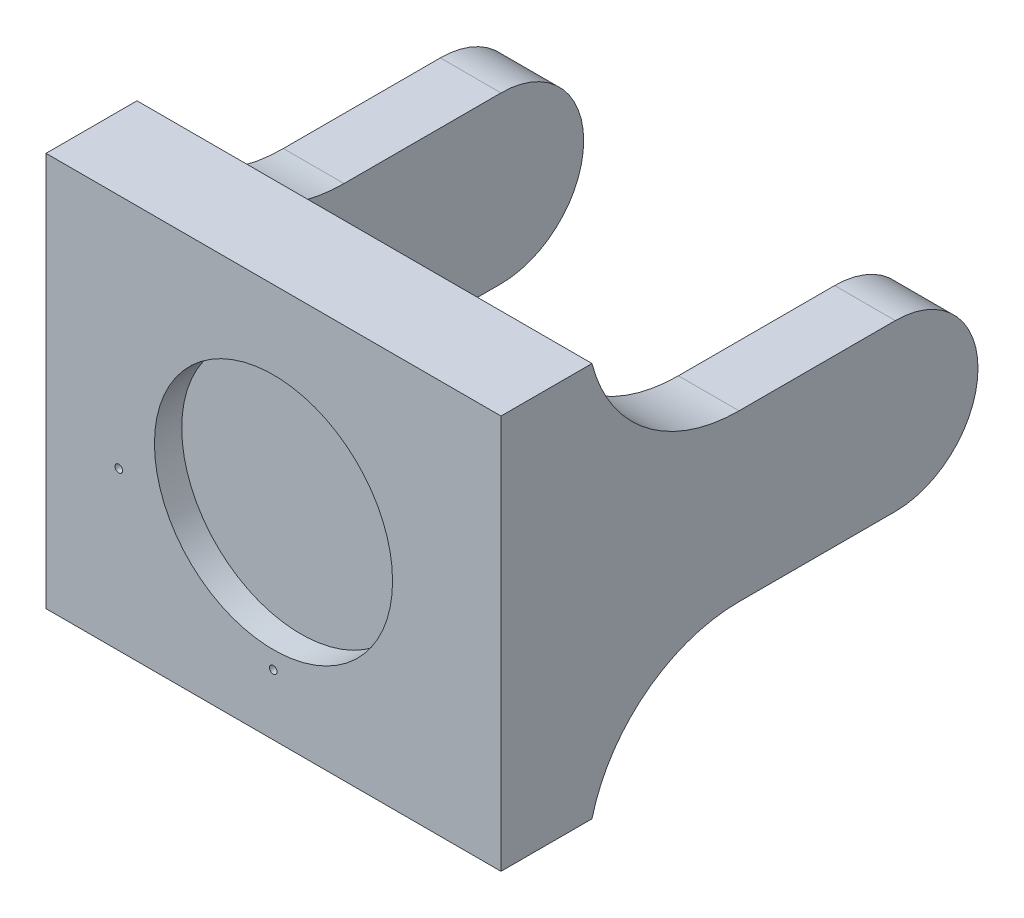
ISO-10303-21;
HEADER;
FILE_DESCRIPTION(('STEP AP214'),'2;1');
FILE_NAME('part.step','',(''),(''),'','','');
FILE_SCHEMA(('AUTOMOTIVE_DESIGN { 1 0 10303 214 1 1 1 1 }'));
ENDSEC;
DATA;
#1=APPLICATION_CONTEXT('core data for automotive mechanical design processes');
#2=APPLICATION_PROTOCOL_DEFINITION('international standard','automotive_design',2000,#1);
#3=PRODUCT_CONTEXT('',#1,'mechanical');
#4=PRODUCT('Part','Part','',(#3));
#5=PRODUCT_RELATED_PRODUCT_CATEGORY('part','',(#4));
#6=PRODUCT_DEFINITION_FORMATION('','',#4);
#7=PRODUCT_DEFINITION_CONTEXT('part definition',#1,'design');
#8=PRODUCT_DEFINITION('design','',#6,#7);
#9=PRODUCT_DEFINITION_SHAPE('','',#8);
#10=(LENGTH_UNIT() NAMED_UNIT(*) SI_UNIT(.MILLI.,.METRE.));
#11=(NAMED_UNIT(*) PLANE_ANGLE_UNIT() SI_UNIT($,.RADIAN.));
#12=(NAMED_UNIT(*) SI_UNIT($,.STERADIAN.) SOLID_ANGLE_UNIT());
#13=UNCERTAINTY_MEASURE_WITH_UNIT(LENGTH_MEASURE(1.E-05),#10,'distance_accuracy_value','');
#14=(GEOMETRIC_REPRESENTATION_CONTEXT(3) GLOBAL_UNCERTAINTY_ASSIGNED_CONTEXT((#13)) GLOBAL_UNIT_ASSIGNED_CONTEXT((#10,
#11,#12)) REPRESENTATION_CONTEXT('',''));
#15=CARTESIAN_POINT('',(0.,0.,0.));
#16=DIRECTION('',(0.,0.,1.));
#17=DIRECTION('',(1.,0.,0.));
#18=AXIS2_PLACEMENT_3D('',#15,#16,#17);
#19=CARTESIAN_POINT('',(0.,0.,-30.));
#20=DIRECTION('',(0.,0.,1.));
#21=DIRECTION('',(1.,0.,0.));
#22=AXIS2_PLACEMENT_3D('',#19,#20,#21);
#23=PLANE('',#22);
#24=CARTESIAN_POINT('',(-51.,-13.,-30.));
#25=DIRECTION('',(0.,0.,1.));
#26=DIRECTION('',(1.,0.,0.));
#27=AXIS2_PLACEMENT_3D('',#24,#25,#26);
#28=CIRCLE('',#27,1.24999999999998);
#29=CARTESIAN_POINT('',(-49.75,-13.,-30.));
#30=VERTEX_POINT('',#29);
#31=EDGE_CURVE('E667',#30,#30,#28,.F.);
#32=ORIENTED_EDGE('',*,*,#31,.F.);
#33=EDGE_LOOP('',(#32));
#34=FACE_BOUND('',#33,.T.);
#35=DIRECTION('',(0.,1.,0.));
#36=VECTOR('',#35,1.);
#37=CARTESIAN_POINT('',(55.,0.,-30.));
#38=LINE('',#37,#36);
#39=CARTESIAN_POINT('',(55.,-65.,-30.));
#40=VERTEX_POINT('',#39);
#41=CARTESIAN_POINT('',(55.,65.,-30.));
#42=VERTEX_POINT('',#41);
#43=EDGE_CURVE('E186',#40,#42,#38,.T.);
#44=ORIENTED_EDGE('',*,*,#43,.F.);
#45=DIRECTION('',(1.,0.,0.));
#46=VECTOR('',#45,1.);
#47=CARTESIAN_POINT('',(-75.,-65.,-30.));
#48=LINE('',#47,#46);
#49=CARTESIAN_POINT('',(-55.,-65.,-30.));
#50=VERTEX_POINT('',#49);
#51=EDGE_CURVE('E292',#50,#40,#48,.T.);
#52=ORIENTED_EDGE('',*,*,#51,.F.);
#53=DIRECTION('',(0.,1.,0.));
#54=VECTOR('',#53,1.);
#55=CARTESIAN_POINT('',(-55.,0.,-30.));
#56=LINE('',#55,#54);
#57=CARTESIAN_POINT('',(-55.,64.1328371247349,-30.));
#58=VERTEX_POINT('',#57);
#59=EDGE_CURVE('E255',#50,#58,#56,.T.);
#60=ORIENTED_EDGE('',*,*,#59,.T.);
#61=DIRECTION('',(1.,0.,0.));
#62=VECTOR('',#61,1.);
#63=CARTESIAN_POINT('',(0.,64.1328371247349,-30.));
#64=LINE('',#63,#62);
#65=CARTESIAN_POINT('',(-74.9911378805656,64.1328371247349,-30.));
#66=VERTEX_POINT('',#65);
#67=EDGE_CURVE('E414',#58,#66,#64,.F.);
#68=ORIENTED_EDGE('',*,*,#67,.T.);
#69=CARTESIAN_POINT('',(-74.,64.,-30.));
#70=DIRECTION('',(0.,0.,1.));
#71=DIRECTION('',(1.,0.,0.));
#72=AXIS2_PLACEMENT_3D('',#69,#70,#71);
#73=CIRCLE('',#72,1.);
#74=CARTESIAN_POINT('',(-75.,64.,-30.));
#75=VERTEX_POINT('',#74);
#76=EDGE_CURVE('E239',#75,#66,#73,.F.);
#77=ORIENTED_EDGE('',*,*,#76,.F.);
#78=DIRECTION('',(0.,1.,0.));
#79=VECTOR('',#78,1.);
#80=CARTESIAN_POINT('',(-75.,-65.,-30.));
#81=LINE('',#80,#79);
#82=CARTESIAN_POINT('',(-75.,65.,-30.));
#83=VERTEX_POINT('',#82);
#84=EDGE_CURVE('E215',#75,#83,#81,.T.);
#85=ORIENTED_EDGE('',*,*,#84,.T.);
#86=DIRECTION('',(-1.,0.,0.));
#87=VECTOR('',#86,1.);
#88=CARTESIAN_POINT('',(75.,65.,-30.));
#89=LINE('',#88,#87);
#90=EDGE_CURVE('E209',#42,#83,#89,.T.);
#91=ORIENTED_EDGE('',*,*,#90,.F.);
#92=EDGE_LOOP('',(#44,#52,#60,#68,#77,#85,#91));
#93=FACE_BOUND('',#92,.T.);
#94=CARTESIAN_POINT('',(-0.0775198210214895,-44.9998861764557,-30.));
#95=DIRECTION('',(0.,0.,1.));
#96=DIRECTION('',(1.,0.,0.));
#97=AXIS2_PLACEMENT_3D('',#94,#95,#96);
#98=CIRCLE('',#97,1.24999999999999);
#99=CARTESIAN_POINT('',(1.1724801789785,-44.9998861764557,-30.));
#100=VERTEX_POINT('',#99);
#101=EDGE_CURVE('E677',#100,#100,#98,.F.);
#102=ORIENTED_EDGE('',*,*,#101,.F.);
#103=EDGE_LOOP('',(#102));
#104=FACE_BOUND('',#103,.T.);
#105=ADVANCED_FACE('F41',(#34,#93,#104),#23,.F.);
#106=CARTESIAN_POINT('',(0.,0.,-30.));
#107=DIRECTION('',(0.,0.,1.));
#108=DIRECTION('',(-1.,0.,0.));
#109=AXIS2_PLACEMENT_3D('',#106,#107,#108);
#110=PLANE('',#109);
#111=CARTESIAN_POINT('',(-74.,-64.,-30.));
#112=DIRECTION('',(0.,0.,1.));
#113=DIRECTION('',(1.,0.,0.));
#114=AXIS2_PLACEMENT_3D('',#111,#112,#113);
#115=CIRCLE('',#114,1.);
#116=CARTESIAN_POINT('',(-74.,-65.,-30.));
#117=VERTEX_POINT('',#116);
#118=CARTESIAN_POINT('',(-75.,-64.,-30.));
#119=VERTEX_POINT('',#118);
#120=EDGE_CURVE('E251',#117,#119,#115,.F.);
#121=ORIENTED_EDGE('',*,*,#120,.F.);
#122=DIRECTION('',(-1.,0.,0.));
#123=VECTOR('',#122,1.);
#124=CARTESIAN_POINT('',(75.,-65.,-30.));
#125=LINE('',#124,#123);
#126=CARTESIAN_POINT('',(-75.,-65.,-30.));
#127=VERTEX_POINT('',#126);
#128=EDGE_CURVE('E206',#117,#127,#125,.T.);
#129=ORIENTED_EDGE('',*,*,#128,.T.);
#130=EDGE_CURVE('E216',#127,#119,#81,.T.);
#131=ORIENTED_EDGE('',*,*,#130,.T.);
#132=EDGE_LOOP('',(#121,#129,#131));
#133=FACE_BOUND('',#132,.T.);
#134=ADVANCED_FACE('F364',(#133),#110,.F.);
#135=CARTESIAN_POINT('',(-55.,0.,-130.));
#136=DIRECTION('',(-1.,0.,0.));
#137=DIRECTION('',(0.,0.,1.));
#138=AXIS2_PLACEMENT_3D('',#135,#136,#137);
#139=CYLINDRICAL_SURFACE('',#138,27.25);
#140=CARTESIAN_POINT('',(-75.,0.,-130.));
#141=DIRECTION('',(-1.,0.,0.));
#142=DIRECTION('',(0.,0.,1.));
#143=AXIS2_PLACEMENT_3D('',#140,#141,#142);
#144=CIRCLE('',#143,27.25);
#145=CARTESIAN_POINT('',(-75.,27.25,-130.));
#146=VERTEX_POINT('',#145);
#147=CARTESIAN_POINT('',(-75.,-27.25,-130.));
#148=VERTEX_POINT('',#147);
#149=EDGE_CURVE('E273',#146,#148,#144,.T.);
#150=ORIENTED_EDGE('',*,*,#149,.F.);
#151=DIRECTION('',(-1.,0.,0.));
#152=VECTOR('',#151,1.);
#153=CARTESIAN_POINT('',(-55.,27.25,-130.));
#154=LINE('',#153,#152);
#155=CARTESIAN_POINT('',(-55.,27.25,-130.));
#156=VERTEX_POINT('',#155);
#157=EDGE_CURVE('E270',#156,#146,#154,.T.);
#158=ORIENTED_EDGE('',*,*,#157,.F.);
#159=CARTESIAN_POINT('',(-55.,0.,-130.));
#160=DIRECTION('',(-1.,0.,0.));
#161=DIRECTION('',(0.,0.,1.));
#162=AXIS2_PLACEMENT_3D('',#159,#160,#161);
#163=CIRCLE('',#162,27.25);
#164=CARTESIAN_POINT('',(-55.,-27.25,-130.));
#165=VERTEX_POINT('',#164);
#166=EDGE_CURVE('E262',#156,#165,#163,.T.);
#167=ORIENTED_EDGE('',*,*,#166,.T.);
#168=DIRECTION('',(-1.,0.,0.));
#169=VECTOR('',#168,1.);
#170=CARTESIAN_POINT('',(-55.,-27.25,-130.));
#171=LINE('',#170,#169);
#172=EDGE_CURVE('E280',#165,#148,#171,.T.);
#173=ORIENTED_EDGE('',*,*,#172,.T.);
#174=EDGE_LOOP('',(#150,#158,#167,#173));
#175=FACE_BOUND('',#174,.T.);
#176=ADVANCED_FACE('F370',(#175),#139,.T.);
#177=CARTESIAN_POINT('',(-55.,-27.25,-30.));
#178=DIRECTION('',(0.,-1.,0.));
#179=DIRECTION('',(0.,0.,-1.));
#180=AXIS2_PLACEMENT_3D('',#177,#178,#179);
#181=PLANE('',#180);
#182=DIRECTION('',(0.,0.,1.));
#183=VECTOR('',#182,1.);
#184=CARTESIAN_POINT('',(-55.,-27.25,-30.));
#185=LINE('',#184,#183);
#186=CARTESIAN_POINT('',(-55.,-27.25,-78.4761539315981));
#187=VERTEX_POINT('',#186);
#188=EDGE_CURVE('E266',#165,#187,#185,.T.);
#189=ORIENTED_EDGE('',*,*,#188,.T.);
#190=DIRECTION('',(-1.,0.,0.));
#191=VECTOR('',#190,1.);
#192=CARTESIAN_POINT('',(-75.,-27.25,-78.4761539315981));
#193=LINE('',#192,#191);
#194=CARTESIAN_POINT('',(-75.,-27.25,-78.4761539315981));
#195=VERTEX_POINT('',#194);
#196=EDGE_CURVE('E299',#187,#195,#193,.T.);
#197=ORIENTED_EDGE('',*,*,#196,.T.);
#198=DIRECTION('',(0.,0.,1.));
#199=VECTOR('',#198,1.);
#200=CARTESIAN_POINT('',(-75.,-27.25,-30.));
#201=LINE('',#200,#199);
#202=EDGE_CURVE('E259',#148,#195,#201,.T.);
#203=ORIENTED_EDGE('',*,*,#202,.F.);
#204=ORIENTED_EDGE('',*,*,#172,.F.);
#205=EDGE_LOOP('',(#189,#197,#203,#204));
#206=FACE_BOUND('',#205,.T.);
#207=ADVANCED_FACE('F450',(#206),#181,.T.);
#208=CARTESIAN_POINT('',(0.,-77.25,-78.4761539315981));
#209=DIRECTION('',(1.,0.,0.));
#210=DIRECTION('',(0.,0.,-1.));
#211=AXIS2_PLACEMENT_3D('',#208,#209,#210);
#212=CYLINDRICAL_SURFACE('',#211,50.);
#213=CARTESIAN_POINT('',(-55.,-77.25,-78.4761539315981));
#214=DIRECTION('',(-1.,0.,0.));
#215=DIRECTION('',(0.,0.,1.));
#216=AXIS2_PLACEMENT_3D('',#213,#214,#215);
#217=CIRCLE('',#216,50.);
#218=EDGE_CURVE('E319',#50,#187,#217,.T.);
#219=ORIENTED_EDGE('',*,*,#218,.F.);
#220=EDGE_CURVE('E287',#117,#50,#48,.T.);
#221=ORIENTED_EDGE('',*,*,#220,.F.);
#222=CARTESIAN_POINT('',(-75.,-64.,-30.2637333327525));
#223=CARTESIAN_POINT('',(-75.0000416496368,-64.0575924178657,-30.2479011670696));
#224=CARTESIAN_POINT('',(-74.995026492553,-64.1152179272787,-30.2321793912983));
#225=CARTESIAN_POINT('',(-74.9751398604718,-64.2289397762001,-30.2013639041426));
#226=CARTESIAN_POINT('',(-74.9602644998208,-64.2850355037836,-30.1862704428541));
#227=CARTESIAN_POINT('',(-74.9208963107575,-64.3941066152334,-30.1571180683805));
#228=CARTESIAN_POINT('',(-74.8963942947588,-64.4470789624666,-30.1430601587812));
#229=CARTESIAN_POINT('',(-74.8383717710064,-64.5482032591565,-30.1163866904383));
#230=CARTESIAN_POINT('',(-74.804856108675,-64.5963577794826,-30.1037703619278));
#231=CARTESIAN_POINT('',(-74.7303952352613,-64.6854396262048,-30.08055592438));
#232=CARTESIAN_POINT('',(-74.6896076437595,-64.726489571544,-30.0699232575879));
#233=CARTESIAN_POINT('',(-74.6012667212078,-64.8011371411689,-30.050671967643));
#234=CARTESIAN_POINT('',(-74.553712548313,-64.8347338368469,-30.0420535954461));
#235=CARTESIAN_POINT('',(-74.4548597279026,-64.8923403691866,-30.0273241494318));
#236=CARTESIAN_POINT('',(-74.4037313552836,-64.9166245006849,-30.0211411627665));
#237=CARTESIAN_POINT('',(-74.2979334213644,-64.9562520451144,-30.0110718261705));
#238=CARTESIAN_POINT('',(-74.2432676467287,-64.9716048483782,-30.007183064048));
#239=CARTESIAN_POINT('',(-74.1567729723377,-64.9881379943687,-30.0029987332421));
#240=CARTESIAN_POINT('',(-74.1255721012649,-64.9925841287484,-30.0018744511511));
#241=CARTESIAN_POINT('',(-74.0629193235958,-64.9985138057951,-30.0003755491702));
#242=CARTESIAN_POINT('',(-74.0314678606897,-65.0000017560953,-29.9999998139593));
#243=CARTESIAN_POINT('',(-74.,-65.,-30.));
#244=B_SPLINE_CURVE_WITH_KNOTS('',3,(#222,#223,#224,#225,#226,#227,#228,#229,#230,#231,#232,
#233,#234,#235,#236,#237,#238,#239,#240,#241,#242,#243),.UNSPECIFIED.,.F.,.F.,(4,2,2,2,2,2,2,2,
2,2,4),(0.,0.17898279730407,0.358036169110385,0.537260844452382,0.716389366764897,
0.892024902385237,1.06768230833427,1.23767331175434,1.40748526335384,1.5019601459293,
1.59629415706593),.UNSPECIFIED.);
#245=CARTESIAN_POINT('',(-75.,-64.,-30.2637333327525));
#246=VERTEX_POINT('',#245);
#247=EDGE_CURVE('E310',#246,#117,#244,.T.);
#248=ORIENTED_EDGE('',*,*,#247,.F.);
#249=CARTESIAN_POINT('',(-75.,-77.25,-78.4761539315981));
#250=DIRECTION('',(1.,0.,0.));
#251=DIRECTION('',(0.,0.,-1.));
#252=AXIS2_PLACEMENT_3D('',#249,#250,#251);
#253=CIRCLE('',#252,50.);
#254=EDGE_CURVE('E306',#195,#246,#253,.T.);
#255=ORIENTED_EDGE('',*,*,#254,.F.);
#256=ORIENTED_EDGE('',*,*,#196,.F.);
#257=EDGE_LOOP('',(#219,#221,#248,#255,#256));
#258=FACE_BOUND('',#257,.T.);
#259=ADVANCED_FACE('F321',(#258),#212,.F.);
#260=CARTESIAN_POINT('',(-74.,-64.,-30.));
#261=DIRECTION('',(0.,0.,-1.));
#262=DIRECTION('',(-1.,0.,0.));
#263=AXIS2_PLACEMENT_3D('',#260,#261,#262);
#264=CYLINDRICAL_SURFACE('',#263,1.);
#265=ORIENTED_EDGE('',*,*,#247,.T.);
#266=ORIENTED_EDGE('',*,*,#120,.T.);
#267=DIRECTION('',(0.,0.,1.));
#268=VECTOR('',#267,1.);
#269=CARTESIAN_POINT('',(-75.,-64.,0.));
#270=LINE('',#269,#268);
#271=EDGE_CURVE('E295',#246,#119,#270,.T.);
#272=ORIENTED_EDGE('',*,*,#271,.F.);
#273=EDGE_LOOP('',(#265,#266,#272));
#274=FACE_BOUND('',#273,.T.);
#275=ADVANCED_FACE('F325',(#274),#264,.T.);
#276=CARTESIAN_POINT('',(-75.,-65.,-30.));
#277=DIRECTION('',(1.,0.,0.));
#278=DIRECTION('',(0.,0.,-1.));
#279=AXIS2_PLACEMENT_3D('',#276,#277,#278);
#280=PLANE('',#279);
#281=ORIENTED_EDGE('',*,*,#84,.F.);
#282=DIRECTION('',(0.,0.,1.));
#283=VECTOR('',#282,1.);
#284=CARTESIAN_POINT('',(-75.,64.,-30.));
#285=LINE('',#284,#283);
#286=CARTESIAN_POINT('',(-75.,64.,-30.0363103492711));
#287=VERTEX_POINT('',#286);
#288=EDGE_CURVE('E291',#75,#287,#285,.F.);
#289=ORIENTED_EDGE('',*,*,#288,.T.);
#290=CARTESIAN_POINT('',(-75.,77.25,-78.2487309481168));
#291=DIRECTION('',(1.,0.,0.));
#292=DIRECTION('',(0.,0.,-1.));
#293=AXIS2_PLACEMENT_3D('',#290,#291,#292);
#294=CIRCLE('',#293,50.);
#295=CARTESIAN_POINT('',(-75.,27.25,-78.2487309481168));
#296=VERTEX_POINT('',#295);
#297=EDGE_CURVE('E346',#287,#296,#294,.T.);
#298=ORIENTED_EDGE('',*,*,#297,.T.);
#299=DIRECTION('',(0.,0.,-1.));
#300=VECTOR('',#299,1.);
#301=CARTESIAN_POINT('',(-75.,27.25,-30.));
#302=LINE('',#301,#300);
#303=EDGE_CURVE('E254',#296,#146,#302,.T.);
#304=ORIENTED_EDGE('',*,*,#303,.T.);
#305=ORIENTED_EDGE('',*,*,#149,.T.);
#306=ORIENTED_EDGE('',*,*,#202,.T.);
#307=ORIENTED_EDGE('',*,*,#254,.T.);
#308=ORIENTED_EDGE('',*,*,#271,.T.);
#309=ORIENTED_EDGE('',*,*,#130,.F.);
#310=DIRECTION('',(0.,0.,1.));
#311=VECTOR('',#310,1.);
#312=CARTESIAN_POINT('',(-75.,-65.,-30.));
#313=LINE('',#312,#311);
#314=CARTESIAN_POINT('',(-75.,-65.,0.));
#315=VERTEX_POINT('',#314);
#316=EDGE_CURVE('E235',#127,#315,#313,.T.);
#317=ORIENTED_EDGE('',*,*,#316,.T.);
#318=DIRECTION('',(0.,1.,0.));
#319=VECTOR('',#318,1.);
#320=CARTESIAN_POINT('',(-75.,-65.,0.));
#321=LINE('',#320,#319);
#322=CARTESIAN_POINT('',(-75.,65.,0.));
#323=VERTEX_POINT('',#322);
#324=EDGE_CURVE('E210',#315,#323,#321,.T.);
#325=ORIENTED_EDGE('',*,*,#324,.T.);
#326=DIRECTION('',(0.,0.,1.));
#327=VECTOR('',#326,1.);
#328=CARTESIAN_POINT('',(-75.,65.,-30.));
#329=LINE('',#328,#327);
#330=EDGE_CURVE('E240',#83,#323,#329,.T.);
#331=ORIENTED_EDGE('',*,*,#330,.F.);
#332=EDGE_LOOP('',(#281,#289,#298,#304,#305,#306,#307,#308,#309,#317,#325,#331));
#333=FACE_BOUND('',#332,.T.);
#334=ADVANCED_FACE('F329',(#333),#280,.F.);
#335=CARTESIAN_POINT('',(-55.,27.25,-30.));
#336=DIRECTION('',(0.,1.,0.));
#337=DIRECTION('',(0.,0.,1.));
#338=AXIS2_PLACEMENT_3D('',#335,#336,#337);
#339=PLANE('',#338);
#340=ORIENTED_EDGE('',*,*,#303,.F.);
#341=DIRECTION('',(-1.,0.,0.));
#342=VECTOR('',#341,1.);
#343=CARTESIAN_POINT('',(-55.,27.25,-78.2487309481168));
#344=LINE('',#343,#342);
#345=CARTESIAN_POINT('',(-55.,27.25,-78.2487309481168));
#346=VERTEX_POINT('',#345);
#347=EDGE_CURVE('E303',#296,#346,#344,.F.);
#348=ORIENTED_EDGE('',*,*,#347,.T.);
#349=DIRECTION('',(0.,0.,-1.));
#350=VECTOR('',#349,1.);
#351=CARTESIAN_POINT('',(-55.,27.25,-30.));
#352=LINE('',#351,#350);
#353=EDGE_CURVE('E258',#346,#156,#352,.T.);
#354=ORIENTED_EDGE('',*,*,#353,.T.);
#355=ORIENTED_EDGE('',*,*,#157,.T.);
#356=EDGE_LOOP('',(#340,#348,#354,#355));
#357=FACE_BOUND('',#356,.T.);
#358=ADVANCED_FACE('F352',(#357),#339,.T.);
#359=CARTESIAN_POINT('',(0.,77.25,-78.2487309481168));
#360=DIRECTION('',(1.,0.,0.));
#361=DIRECTION('',(0.,0.,-1.));
#362=AXIS2_PLACEMENT_3D('',#359,#360,#361);
#363=CYLINDRICAL_SURFACE('',#362,50.);
#364=ORIENTED_EDGE('',*,*,#67,.F.);
#365=CARTESIAN_POINT('',(-55.,77.25,-78.2487309481168));
#366=DIRECTION('',(-1.,0.,0.));
#367=DIRECTION('',(0.,0.,1.));
#368=AXIS2_PLACEMENT_3D('',#365,#366,#367);
#369=CIRCLE('',#368,50.);
#370=EDGE_CURVE('E411',#346,#58,#369,.T.);
#371=ORIENTED_EDGE('',*,*,#370,.F.);
#372=ORIENTED_EDGE('',*,*,#347,.F.);
#373=ORIENTED_EDGE('',*,*,#297,.F.);
#374=CARTESIAN_POINT('',(-74.9656613911395,64.2598039215686,-29.9656613911395));
#375=CARTESIAN_POINT('',(-74.9770936777038,64.2171742002458,-29.977128574765));
#376=CARTESIAN_POINT('',(-74.9856713717243,64.1742090127871,-29.9887495797553));
#377=CARTESIAN_POINT('',(-74.9971175746778,64.0876077055976,-30.0122992324659));
#378=CARTESIAN_POINT('',(-74.9999860836108,64.0439715858667,-30.0242278801861));
#379=CARTESIAN_POINT('',(-75.,64.,-30.0363103492711));
#380=B_SPLINE_CURVE_WITH_KNOTS('',3,(#374,#375,#376,#377,#378,#379),.UNSPECIFIED.,.F.,.F.,(4,2,
4),(0.,0.135984143654628,0.271968287310708),.UNSPECIFIED.);
#381=EDGE_CURVE('E338',#66,#287,#380,.T.);
#382=ORIENTED_EDGE('',*,*,#381,.F.);
#383=EDGE_LOOP('',(#364,#371,#372,#373,#382));
#384=FACE_BOUND('',#383,.T.);
#385=ADVANCED_FACE('F348',(#384),#363,.F.);
#386=CARTESIAN_POINT('',(-55.,0.,-130.));
#387=DIRECTION('',(-1.,0.,0.));
#388=DIRECTION('',(0.,0.,1.));
#389=AXIS2_PLACEMENT_3D('',#386,#387,#388);
#390=PLANE('',#389);
#391=ORIENTED_EDGE('',*,*,#370,.T.);
#392=ORIENTED_EDGE('',*,*,#59,.F.);
#393=ORIENTED_EDGE('',*,*,#218,.T.);
#394=ORIENTED_EDGE('',*,*,#188,.F.);
#395=ORIENTED_EDGE('',*,*,#166,.F.);
#396=ORIENTED_EDGE('',*,*,#353,.F.);
#397=EDGE_LOOP('',(#391,#392,#393,#394,#395,#396));
#398=FACE_BOUND('',#397,.T.);
#399=ADVANCED_FACE('F351',(#398),#390,.F.);
#400=CARTESIAN_POINT('',(-75.,-65.,-30.));
#401=DIRECTION('',(0.,-1.,0.));
#402=DIRECTION('',(0.,0.,-1.));
#403=AXIS2_PLACEMENT_3D('',#400,#401,#402);
#404=PLANE('',#403);
#405=ORIENTED_EDGE('',*,*,#128,.F.);
#406=ORIENTED_EDGE('',*,*,#220,.T.);
#407=ORIENTED_EDGE('',*,*,#51,.T.);
#408=CARTESIAN_POINT('',(75.,-65.,-30.));
#409=VERTEX_POINT('',#408);
#410=EDGE_CURVE('E283',#40,#409,#48,.T.);
#411=ORIENTED_EDGE('',*,*,#410,.T.);
#412=DIRECTION('',(0.,0.,1.));
#413=VECTOR('',#412,1.);
#414=CARTESIAN_POINT('',(75.,-65.,-30.));
#415=LINE('',#414,#413);
#416=CARTESIAN_POINT('',(75.,-65.,0.));
#417=VERTEX_POINT('',#416);
#418=EDGE_CURVE('E220',#409,#417,#415,.T.);
#419=ORIENTED_EDGE('',*,*,#418,.T.);
#420=DIRECTION('',(-1.,0.,0.));
#421=VECTOR('',#420,1.);
#422=CARTESIAN_POINT('',(75.,-65.,0.));
#423=LINE('',#422,#421);
#424=EDGE_CURVE('E204',#417,#315,#423,.T.);
#425=ORIENTED_EDGE('',*,*,#424,.T.);
#426=ORIENTED_EDGE('',*,*,#316,.F.);
#427=EDGE_LOOP('',(#405,#406,#407,#411,#419,#425,#426));
#428=FACE_BOUND('',#427,.T.);
#429=ADVANCED_FACE('F331',(#428),#404,.T.);
#430=CARTESIAN_POINT('',(-74.,64.,-30.));
#431=DIRECTION('',(0.,0.,1.));
#432=DIRECTION('',(1.,0.,0.));
#433=AXIS2_PLACEMENT_3D('',#430,#431,#432);
#434=CYLINDRICAL_SURFACE('',#433,1.);
#435=ORIENTED_EDGE('',*,*,#288,.F.);
#436=ORIENTED_EDGE('',*,*,#76,.T.);
#437=ORIENTED_EDGE('',*,*,#381,.T.);
#438=EDGE_LOOP('',(#435,#436,#437));
#439=FACE_BOUND('',#438,.T.);
#440=ADVANCED_FACE('F333',(#439),#434,.T.);
#441=CARTESIAN_POINT('',(0.,0.,0.));
#442=DIRECTION('',(0.,0.,1.));
#443=DIRECTION('',(1.,0.,0.));
#444=AXIS2_PLACEMENT_3D('',#441,#442,#443);
#445=PLANE('',#444);
#446=CARTESIAN_POINT('',(-0.0775198210214895,-44.9998861764557,0.));
#447=DIRECTION('',(0.,0.,1.));
#448=DIRECTION('',(1.,0.,0.));
#449=AXIS2_PLACEMENT_3D('',#446,#447,#448);
#450=CIRCLE('',#449,1.24999999999999);
#451=CARTESIAN_POINT('',(1.1724801789785,-44.9998861764557,0.));
#452=VERTEX_POINT('',#451);
#453=EDGE_CURVE('E679',#452,#452,#450,.T.);
#454=ORIENTED_EDGE('',*,*,#453,.F.);
#455=EDGE_LOOP('',(#454));
#456=FACE_BOUND('',#455,.T.);
#457=CARTESIAN_POINT('',(-51.,-13.,0.));
#458=DIRECTION('',(0.,0.,1.));
#459=DIRECTION('',(1.,0.,0.));
#460=AXIS2_PLACEMENT_3D('',#457,#458,#459);
#461=CIRCLE('',#460,1.24999999999999);
#462=CARTESIAN_POINT('',(-49.75,-13.,0.));
#463=VERTEX_POINT('',#462);
#464=EDGE_CURVE('E672',#463,#463,#461,.T.);
#465=ORIENTED_EDGE('',*,*,#464,.F.);
#466=EDGE_LOOP('',(#465));
#467=FACE_BOUND('',#466,.T.);
#468=CARTESIAN_POINT('',(0.,0.,0.));
#469=DIRECTION('',(0.,0.,1.));
#470=DIRECTION('',(1.,0.,0.));
#471=AXIS2_PLACEMENT_3D('',#468,#469,#470);
#472=CIRCLE('',#471,39.25);
#473=CARTESIAN_POINT('',(39.25,0.,0.));
#474=VERTEX_POINT('',#473);
#475=EDGE_CURVE('E664',#474,#474,#472,.T.);
#476=ORIENTED_EDGE('',*,*,#475,.F.);
#477=EDGE_LOOP('',(#476));
#478=FACE_BOUND('',#477,.T.);
#479=ORIENTED_EDGE('',*,*,#424,.F.);
#480=DIRECTION('',(0.,1.,0.));
#481=VECTOR('',#480,1.);
#482=CARTESIAN_POINT('',(75.,-65.,0.));
#483=LINE('',#482,#481);
#484=CARTESIAN_POINT('',(75.,65.,0.));
#485=VERTEX_POINT('',#484);
#486=EDGE_CURVE('E224',#417,#485,#483,.T.);
#487=ORIENTED_EDGE('',*,*,#486,.T.);
#488=DIRECTION('',(-1.,0.,0.));
#489=VECTOR('',#488,1.);
#490=CARTESIAN_POINT('',(75.,65.,0.));
#491=LINE('',#490,#489);
#492=EDGE_CURVE('E228',#485,#323,#491,.T.);
#493=ORIENTED_EDGE('',*,*,#492,.T.);
#494=ORIENTED_EDGE('',*,*,#324,.F.);
#495=EDGE_LOOP('',(#479,#487,#493,#494));
#496=FACE_BOUND('',#495,.T.);
#497=ADVANCED_FACE('F336',(#456,#467,#478,#496),#445,.T.);
#498=CARTESIAN_POINT('',(75.,-65.,-30.));
#499=DIRECTION('',(1.,0.,0.));
#500=DIRECTION('',(0.,0.,-1.));
#501=AXIS2_PLACEMENT_3D('',#498,#499,#500);
#502=PLANE('',#501);
#503=ORIENTED_EDGE('',*,*,#486,.F.);
#504=ORIENTED_EDGE('',*,*,#418,.F.);
#505=CARTESIAN_POINT('',(75.,-77.25,-78.4761539315981));
#506=DIRECTION('',(1.,0.,0.));
#507=DIRECTION('',(0.,0.,-1.));
#508=AXIS2_PLACEMENT_3D('',#505,#506,#507);
#509=CIRCLE('',#508,50.);
#510=CARTESIAN_POINT('',(75.,-27.25,-78.4761539315981));
#511=VERTEX_POINT('',#510);
#512=EDGE_CURVE('E422',#409,#511,#509,.F.);
#513=ORIENTED_EDGE('',*,*,#512,.T.);
#514=DIRECTION('',(0.,0.,1.));
#515=VECTOR('',#514,1.);
#516=CARTESIAN_POINT('',(75.,-27.25,-30.));
#517=LINE('',#516,#515);
#518=CARTESIAN_POINT('',(75.,-27.25,-130.));
#519=VERTEX_POINT('',#518);
#520=EDGE_CURVE('E195',#519,#511,#517,.T.);
#521=ORIENTED_EDGE('',*,*,#520,.F.);
#522=CARTESIAN_POINT('',(75.,0.,-130.));
#523=DIRECTION('',(-1.,0.,0.));
#524=DIRECTION('',(0.,0.,1.));
#525=AXIS2_PLACEMENT_3D('',#522,#523,#524);
#526=CIRCLE('',#525,27.25);
#527=CARTESIAN_POINT('',(75.,27.25,-130.));
#528=VERTEX_POINT('',#527);
#529=EDGE_CURVE('E175',#528,#519,#526,.T.);
#530=ORIENTED_EDGE('',*,*,#529,.F.);
#531=DIRECTION('',(0.,0.,-1.));
#532=VECTOR('',#531,1.);
#533=CARTESIAN_POINT('',(75.,27.25,-30.));
#534=LINE('',#533,#532);
#535=CARTESIAN_POINT('',(75.,27.25,-78.4761539315982));
#536=VERTEX_POINT('',#535);
#537=EDGE_CURVE('E189',#536,#528,#534,.T.);
#538=ORIENTED_EDGE('',*,*,#537,.F.);
#539=CARTESIAN_POINT('',(75.,77.25,-78.4761539315982));
#540=DIRECTION('',(1.,0.,0.));
#541=DIRECTION('',(0.,0.,-1.));
#542=AXIS2_PLACEMENT_3D('',#539,#540,#541);
#543=CIRCLE('',#542,50.);
#544=CARTESIAN_POINT('',(75.,65.,-30.));
#545=VERTEX_POINT('',#544);
#546=EDGE_CURVE('E50',#536,#545,#543,.F.);
#547=ORIENTED_EDGE('',*,*,#546,.T.);
#548=DIRECTION('',(0.,0.,1.));
#549=VECTOR('',#548,1.);
#550=CARTESIAN_POINT('',(75.,65.,-30.));
#551=LINE('',#550,#549);
#552=EDGE_CURVE('E243',#545,#485,#551,.T.);
#553=ORIENTED_EDGE('',*,*,#552,.T.);
#554=EDGE_LOOP('',(#503,#504,#513,#521,#530,#538,#547,#553));
#555=FACE_BOUND('',#554,.T.);
#556=ADVANCED_FACE('F380',(#555),#502,.T.);
#557=CARTESIAN_POINT('',(-75.,65.,-30.));
#558=DIRECTION('',(0.,-1.,0.));
#559=DIRECTION('',(0.,0.,-1.));
#560=AXIS2_PLACEMENT_3D('',#557,#558,#559);
#561=PLANE('',#560);
#562=ORIENTED_EDGE('',*,*,#492,.F.);
#563=ORIENTED_EDGE('',*,*,#552,.F.);
#564=EDGE_CURVE('E211',#545,#42,#89,.T.);
#565=ORIENTED_EDGE('',*,*,#564,.T.);
#566=ORIENTED_EDGE('',*,*,#90,.T.);
#567=ORIENTED_EDGE('',*,*,#330,.T.);
#568=EDGE_LOOP('',(#562,#563,#565,#566,#567));
#569=FACE_BOUND('',#568,.T.);
#570=ADVANCED_FACE('F385',(#569),#561,.F.);
#571=CARTESIAN_POINT('',(55.,27.25,-30.));
#572=DIRECTION('',(0.,-1.,0.));
#573=DIRECTION('',(0.,0.,-1.));
#574=AXIS2_PLACEMENT_3D('',#571,#572,#573);
#575=PLANE('',#574);
#576=DIRECTION('',(0.,0.,-1.));
#577=VECTOR('',#576,1.);
#578=CARTESIAN_POINT('',(55.,27.25,-30.));
#579=LINE('',#578,#577);
#580=CARTESIAN_POINT('',(55.,27.25,-78.4761539315982));
#581=VERTEX_POINT('',#580);
#582=CARTESIAN_POINT('',(55.,27.25,-130.));
#583=VERTEX_POINT('',#582);
#584=EDGE_CURVE('E165',#581,#583,#579,.T.);
#585=ORIENTED_EDGE('',*,*,#584,.F.);
#586=DIRECTION('',(1.,0.,0.));
#587=VECTOR('',#586,1.);
#588=CARTESIAN_POINT('',(55.,27.25,-78.4761539315982));
#589=LINE('',#588,#587);
#590=EDGE_CURVE('E419',#581,#536,#589,.T.);
#591=ORIENTED_EDGE('',*,*,#590,.T.);
#592=ORIENTED_EDGE('',*,*,#537,.T.);
#593=DIRECTION('',(1.,0.,0.));
#594=VECTOR('',#593,1.);
#595=CARTESIAN_POINT('',(55.,27.25,-130.));
#596=LINE('',#595,#594);
#597=EDGE_CURVE('E180',#583,#528,#596,.T.);
#598=ORIENTED_EDGE('',*,*,#597,.F.);
#599=EDGE_LOOP('',(#585,#591,#592,#598));
#600=FACE_BOUND('',#599,.T.);
#601=ADVANCED_FACE('F387',(#600),#575,.F.);
#602=CARTESIAN_POINT('',(55.,0.,-130.));
#603=DIRECTION('',(1.,0.,0.));
#604=DIRECTION('',(0.,0.,-1.));
#605=AXIS2_PLACEMENT_3D('',#602,#603,#604);
#606=CYLINDRICAL_SURFACE('',#605,27.25);
#607=ORIENTED_EDGE('',*,*,#529,.T.);
#608=DIRECTION('',(1.,0.,0.));
#609=VECTOR('',#608,1.);
#610=CARTESIAN_POINT('',(55.,-27.25,-130.));
#611=LINE('',#610,#609);
#612=CARTESIAN_POINT('',(55.,-27.25,-130.));
#613=VERTEX_POINT('',#612);
#614=EDGE_CURVE('E172',#613,#519,#611,.T.);
#615=ORIENTED_EDGE('',*,*,#614,.F.);
#616=CARTESIAN_POINT('',(55.,0.,-130.));
#617=DIRECTION('',(-1.,0.,0.));
#618=DIRECTION('',(0.,0.,1.));
#619=AXIS2_PLACEMENT_3D('',#616,#617,#618);
#620=CIRCLE('',#619,27.25);
#621=EDGE_CURVE('E158',#583,#613,#620,.T.);
#622=ORIENTED_EDGE('',*,*,#621,.F.);
#623=ORIENTED_EDGE('',*,*,#597,.T.);
#624=EDGE_LOOP('',(#607,#615,#622,#623));
#625=FACE_BOUND('',#624,.T.);
#626=ADVANCED_FACE('F173',(#625),#606,.T.);
#627=CARTESIAN_POINT('',(55.,-27.25,-30.));
#628=DIRECTION('',(0.,1.,0.));
#629=DIRECTION('',(0.,0.,1.));
#630=AXIS2_PLACEMENT_3D('',#627,#628,#629);
#631=PLANE('',#630);
#632=ORIENTED_EDGE('',*,*,#520,.T.);
#633=DIRECTION('',(1.,0.,0.));
#634=VECTOR('',#633,1.);
#635=CARTESIAN_POINT('',(55.,-27.25,-78.4761539315981));
#636=LINE('',#635,#634);
#637=CARTESIAN_POINT('',(55.,-27.25,-78.4761539315981));
#638=VERTEX_POINT('',#637);
#639=EDGE_CURVE('E184',#511,#638,#636,.F.);
#640=ORIENTED_EDGE('',*,*,#639,.T.);
#641=DIRECTION('',(0.,0.,1.));
#642=VECTOR('',#641,1.);
#643=CARTESIAN_POINT('',(55.,-27.25,-30.));
#644=LINE('',#643,#642);
#645=EDGE_CURVE('E163',#613,#638,#644,.T.);
#646=ORIENTED_EDGE('',*,*,#645,.F.);
#647=ORIENTED_EDGE('',*,*,#614,.T.);
#648=EDGE_LOOP('',(#632,#640,#646,#647));
#649=FACE_BOUND('',#648,.T.);
#650=ADVANCED_FACE('F182',(#649),#631,.F.);
#651=CARTESIAN_POINT('',(55.,0.,-130.));
#652=DIRECTION('',(1.,0.,0.));
#653=DIRECTION('',(0.,0.,1.));
#654=AXIS2_PLACEMENT_3D('',#651,#652,#653);
#655=PLANE('',#654);
#656=ORIENTED_EDGE('',*,*,#43,.T.);
#657=CARTESIAN_POINT('',(55.,77.25,-78.4761539315982));
#658=DIRECTION('',(1.,0.,0.));
#659=DIRECTION('',(0.,0.,-1.));
#660=AXIS2_PLACEMENT_3D('',#657,#658,#659);
#661=CIRCLE('',#660,50.);
#662=EDGE_CURVE('E11',#42,#581,#661,.T.);
#663=ORIENTED_EDGE('',*,*,#662,.T.);
#664=ORIENTED_EDGE('',*,*,#584,.T.);
#665=ORIENTED_EDGE('',*,*,#621,.T.);
#666=ORIENTED_EDGE('',*,*,#645,.T.);
#667=CARTESIAN_POINT('',(55.,-77.25,-78.4761539315981));
#668=DIRECTION('',(1.,0.,0.));
#669=DIRECTION('',(0.,0.,-1.));
#670=AXIS2_PLACEMENT_3D('',#667,#668,#669);
#671=CIRCLE('',#670,50.);
#672=EDGE_CURVE('E425',#638,#40,#671,.T.);
#673=ORIENTED_EDGE('',*,*,#672,.T.);
#674=EDGE_LOOP('',(#656,#663,#664,#665,#666,#673));
#675=FACE_BOUND('',#674,.T.);
#676=ADVANCED_FACE('F160',(#675),#655,.F.);
#677=CARTESIAN_POINT('',(0.,-77.25,-78.4761539315981));
#678=DIRECTION('',(1.,0.,0.));
#679=DIRECTION('',(0.,0.,-1.));
#680=AXIS2_PLACEMENT_3D('',#677,#678,#679);
#681=CYLINDRICAL_SURFACE('',#680,50.);
#682=ORIENTED_EDGE('',*,*,#672,.F.);
#683=ORIENTED_EDGE('',*,*,#639,.F.);
#684=ORIENTED_EDGE('',*,*,#512,.F.);
#685=ORIENTED_EDGE('',*,*,#410,.F.);
#686=EDGE_LOOP('',(#682,#683,#684,#685));
#687=FACE_BOUND('',#686,.T.);
#688=ADVANCED_FACE('F354',(#687),#681,.F.);
#689=CARTESIAN_POINT('',(0.,77.25,-78.4761539315982));
#690=DIRECTION('',(1.,0.,0.));
#691=DIRECTION('',(0.,0.,-1.));
#692=AXIS2_PLACEMENT_3D('',#689,#690,#691);
#693=CYLINDRICAL_SURFACE('',#692,50.);
#694=ORIENTED_EDGE('',*,*,#662,.F.);
#695=ORIENTED_EDGE('',*,*,#564,.F.);
#696=ORIENTED_EDGE('',*,*,#546,.F.);
#697=ORIENTED_EDGE('',*,*,#590,.F.);
#698=EDGE_LOOP('',(#694,#695,#696,#697));
#699=FACE_BOUND('',#698,.T.);
#700=ADVANCED_FACE('F43',(#699),#693,.F.);
#701=CARTESIAN_POINT('',(0.,0.,-9.));
#702=DIRECTION('',(0.,0.,1.));
#703=DIRECTION('',(1.,0.,0.));
#704=AXIS2_PLACEMENT_3D('',#701,#702,#703);
#705=CYLINDRICAL_SURFACE('',#704,39.25);
#706=CARTESIAN_POINT('',(0.,0.,-9.));
#707=DIRECTION('',(0.,0.,1.));
#708=DIRECTION('',(1.,0.,0.));
#709=AXIS2_PLACEMENT_3D('',#706,#707,#708);
#710=CIRCLE('',#709,39.25);
#711=CARTESIAN_POINT('',(39.25,0.,-9.));
#712=VERTEX_POINT('',#711);
#713=EDGE_CURVE('E198',#712,#712,#710,.T.);
#714=ORIENTED_EDGE('',*,*,#713,.F.);
#715=EDGE_LOOP('',(#714));
#716=FACE_BOUND('',#715,.T.);
#717=ORIENTED_EDGE('',*,*,#475,.T.);
#718=EDGE_LOOP('',(#717));
#719=FACE_BOUND('',#718,.T.);
#720=ADVANCED_FACE('F361',(#716,#719),#705,.F.);
#721=CARTESIAN_POINT('',(0.,0.,-9.));
#722=DIRECTION('',(0.,0.,1.));
#723=DIRECTION('',(1.,0.,0.));
#724=AXIS2_PLACEMENT_3D('',#721,#722,#723);
#725=PLANE('',#724);
#726=ORIENTED_EDGE('',*,*,#713,.T.);
#727=EDGE_LOOP('',(#726));
#728=FACE_BOUND('',#727,.T.);
#729=ADVANCED_FACE('F516',(#728),#725,.T.);
#730=CARTESIAN_POINT('',(-51.,-13.,0.));
#731=DIRECTION('',(0.,0.,1.));
#732=DIRECTION('',(1.,0.,0.));
#733=AXIS2_PLACEMENT_3D('',#730,#731,#732);
#734=CYLINDRICAL_SURFACE('',#733,1.24999999999998);
#735=ORIENTED_EDGE('',*,*,#31,.T.);
#736=EDGE_LOOP('',(#735));
#737=FACE_BOUND('',#736,.T.);
#738=ORIENTED_EDGE('',*,*,#464,.T.);
#739=EDGE_LOOP('',(#738));
#740=FACE_BOUND('',#739,.T.);
#741=ADVANCED_FACE('F507',(#737,#740),#734,.F.);
#742=CARTESIAN_POINT('',(-0.0775198210214895,-44.9998861764557,0.));
#743=DIRECTION('',(0.,0.,1.));
#744=DIRECTION('',(1.,0.,0.));
#745=AXIS2_PLACEMENT_3D('',#742,#743,#744);
#746=CYLINDRICAL_SURFACE('',#745,1.24999999999999);
#747=ORIENTED_EDGE('',*,*,#101,.T.);
#748=EDGE_LOOP('',(#747));
#749=FACE_BOUND('',#748,.T.);
#750=ORIENTED_EDGE('',*,*,#453,.T.);
#751=EDGE_LOOP('',(#750));
#752=FACE_BOUND('',#751,.T.);
#753=ADVANCED_FACE('F503',(#749,#752),#746,.F.);
#754=CLOSED_SHELL('',(#105,#134,#176,#207,#259,#275,#334,#358,#385,#399,#429,#440,#497,#556,
#570,#601,#626,#650,#676,#688,#700,#720,#729,#741,#753));
#755=MANIFOLD_SOLID_BREP('B2',#754);
#756=ADVANCED_BREP_SHAPE_REPRESENTATION('',(#18,#755),#14);
#757=SHAPE_DEFINITION_REPRESENTATION(#9,#756);
ENDSEC;
END-ISO-10303-21;
